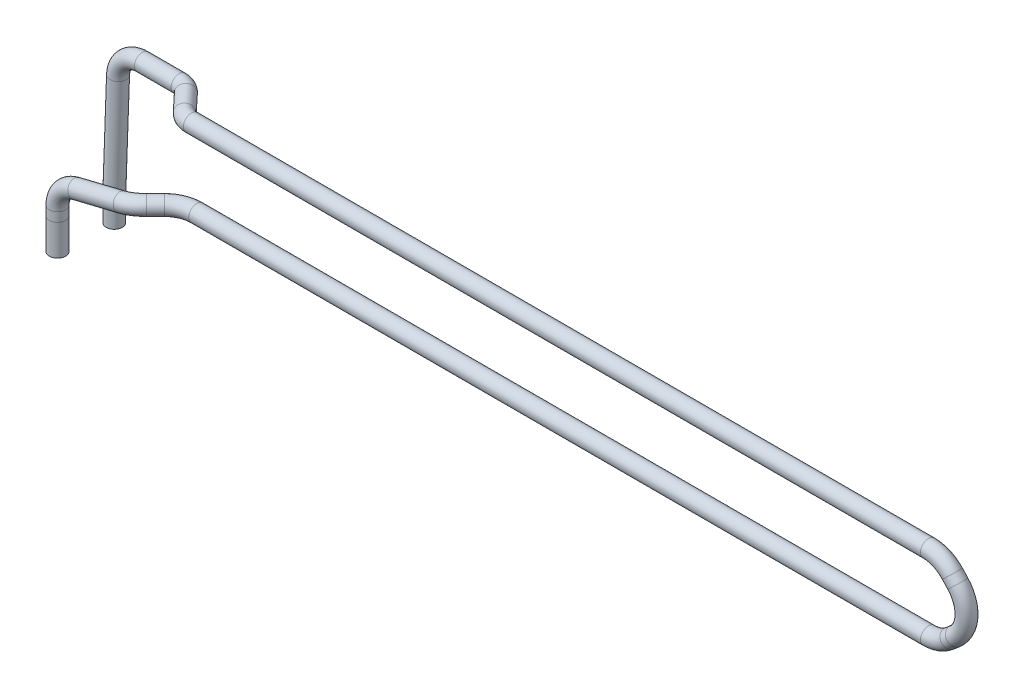
ISO-10303-21;
HEADER;
FILE_DESCRIPTION(('STEP AP214'),'2;1');
FILE_NAME('part.step','',(''),(''),'','','');
FILE_SCHEMA(('AUTOMOTIVE_DESIGN { 1 0 10303 214 1 1 1 1 }'));
ENDSEC;
DATA;
#1=APPLICATION_CONTEXT('core data for automotive mechanical design processes');
#2=APPLICATION_PROTOCOL_DEFINITION('international standard','automotive_design',2000,#1);
#3=PRODUCT_CONTEXT('',#1,'mechanical');
#4=PRODUCT('Part','Part','',(#3));
#5=PRODUCT_RELATED_PRODUCT_CATEGORY('part','',(#4));
#6=PRODUCT_DEFINITION_FORMATION('','',#4);
#7=PRODUCT_DEFINITION_CONTEXT('part definition',#1,'design');
#8=PRODUCT_DEFINITION('design','',#6,#7);
#9=PRODUCT_DEFINITION_SHAPE('','',#8);
#10=(LENGTH_UNIT() NAMED_UNIT(*) SI_UNIT(.MILLI.,.METRE.));
#11=(NAMED_UNIT(*) PLANE_ANGLE_UNIT() SI_UNIT($,.RADIAN.));
#12=(NAMED_UNIT(*) SI_UNIT($,.STERADIAN.) SOLID_ANGLE_UNIT());
#13=UNCERTAINTY_MEASURE_WITH_UNIT(LENGTH_MEASURE(1.E-05),#10,'distance_accuracy_value','');
#14=(GEOMETRIC_REPRESENTATION_CONTEXT(3) GLOBAL_UNCERTAINTY_ASSIGNED_CONTEXT((#13)) GLOBAL_UNIT_ASSIGNED_CONTEXT((#10,
#11,#12)) REPRESENTATION_CONTEXT('',''));
#15=CARTESIAN_POINT('',(0.,0.,0.));
#16=DIRECTION('',(0.,0.,1.));
#17=DIRECTION('',(1.,0.,0.));
#18=AXIS2_PLACEMENT_3D('',#15,#16,#17);
#19=CARTESIAN_POINT('',(-61.7173783748606,-14.4495134647805,-3.16147066816916));
#20=DIRECTION('',(0.,1.,0.));
#21=DIRECTION('',(0.,0.,1.));
#22=AXIS2_PLACEMENT_3D('',#19,#20,#21);
#23=PLANE('',#22);
#24=CARTESIAN_POINT('',(-61.7173783748606,-14.4495134647805,-3.16147066816916));
#25=DIRECTION('',(0.,1.,0.));
#26=DIRECTION('',(0.,0.,1.));
#27=AXIS2_PLACEMENT_3D('',#24,#25,#26);
#28=CIRCLE('',#27,1.);
#29=CARTESIAN_POINT('',(-61.7173783748606,-14.4495134647805,-2.16147066816916));
#30=VERTEX_POINT('',#29);
#31=EDGE_CURVE('E52',#30,#30,#28,.T.);
#32=ORIENTED_EDGE('',*,*,#31,.F.);
#33=EDGE_LOOP('',(#32));
#34=FACE_BOUND('',#33,.T.);
#35=ADVANCED_FACE('F49',(#34),#23,.F.);
#36=CARTESIAN_POINT('',(-62.0906123648648,-14.4017319108807,3.44671250446357));
#37=DIRECTION('',(0.,-1.,0.));
#38=DIRECTION('',(0.0991975804914856,0.,0.995067756499343));
#39=AXIS2_PLACEMENT_3D('',#36,#37,#38);
#40=PLANE('',#39);
#41=CARTESIAN_POINT('',(-62.0906123648648,-14.4017319108807,3.44671250446357));
#42=DIRECTION('',(0.,-1.,0.));
#43=DIRECTION('',(0.0991975804914856,0.,0.995067756499343));
#44=AXIS2_PLACEMENT_3D('',#41,#42,#43);
#45=CIRCLE('',#44,1.);
#46=CARTESIAN_POINT('',(-61.9914147843733,-14.4017319108807,4.44178026096291));
#47=VERTEX_POINT('',#46);
#48=EDGE_CURVE('E11',#47,#47,#45,.T.);
#49=ORIENTED_EDGE('',*,*,#48,.T.);
#50=EDGE_LOOP('',(#49));
#51=FACE_BOUND('',#50,.T.);
#52=ADVANCED_FACE('F78',(#51),#40,.T.);
#53=CARTESIAN_POINT('',(-61.7173783748606,-11.3645869698673,-3.16147066816916));
#54=DIRECTION('',(0.,-1.,0.));
#55=DIRECTION('',(0.,0.,-1.));
#56=AXIS2_PLACEMENT_3D('',#53,#54,#55);
#57=CYLINDRICAL_SURFACE('',#56,1.);
#58=CARTESIAN_POINT('',(-61.7173783748606,-11.5645869698673,-3.16147066816916));
#59=DIRECTION('',(-0.0178043012079039,-0.999841490866677,0.));
#60=DIRECTION('',(-0.999841490866677,0.0178043012079039,0.));
#61=AXIS2_PLACEMENT_3D('',#58,#59,#60);
#62=ELLIPSE('',#61,1.00015853426245,1.);
#63=CARTESIAN_POINT('',(-62.7173783748606,-11.5467798460676,-3.16147066816916));
#64=VERTEX_POINT('',#63);
#65=EDGE_CURVE('E64',#64,#64,#62,.T.);
#66=ORIENTED_EDGE('',*,*,#65,.T.);
#67=EDGE_LOOP('',(#66));
#68=FACE_BOUND('',#67,.T.);
#69=ORIENTED_EDGE('',*,*,#31,.T.);
#70=EDGE_LOOP('',(#69));
#71=FACE_BOUND('',#70,.T.);
#72=ADVANCED_FACE('F75',(#68,#71),#57,.T.);
#73=CARTESIAN_POINT('',(-62.0906123648648,-14.4017319108807,3.44671250446357));
#74=DIRECTION('',(0.,1.,0.));
#75=DIRECTION('',(0.,0.,1.));
#76=AXIS2_PLACEMENT_3D('',#73,#74,#75);
#77=CYLINDRICAL_SURFACE('',#76,1.);
#78=CARTESIAN_POINT('',(-62.0906123648648,-10.5909190140778,3.44671250446357));
#79=DIRECTION('',(0.,-1.,0.));
#80=DIRECTION('',(0.0991975804914856,0.,0.995067756499343));
#81=AXIS2_PLACEMENT_3D('',#78,#79,#80);
#82=CIRCLE('',#81,1.);
#83=CARTESIAN_POINT('',(-61.9914147843733,-10.5909190140778,4.44178026096291));
#84=VERTEX_POINT('',#83);
#85=EDGE_CURVE('E56',#84,#84,#82,.T.);
#86=ORIENTED_EDGE('',*,*,#85,.T.);
#87=EDGE_LOOP('',(#86));
#88=FACE_BOUND('',#87,.T.);
#89=ORIENTED_EDGE('',*,*,#48,.F.);
#90=EDGE_LOOP('',(#89));
#91=FACE_BOUND('',#90,.T.);
#92=ADVANCED_FACE('F97',(#88,#91),#77,.T.);
#93=CARTESIAN_POINT('',(-62.0906123648648,-10.5909190140778,3.44671250446357));
#94=DIRECTION('',(0.,1.,0.));
#95=DIRECTION('',(0.,0.,1.));
#96=AXIS2_PLACEMENT_3D('',#93,#94,#95);
#97=CYLINDRICAL_SURFACE('',#96,1.);
#98=CARTESIAN_POINT('',(-62.0906123648648,-9.45535480034576,3.44671250446357));
#99=DIRECTION('',(0.,-1.,0.));
#100=DIRECTION('',(0.0991975804914856,0.,0.995067756499343));
#101=AXIS2_PLACEMENT_3D('',#98,#99,#100);
#102=CIRCLE('',#101,1.);
#103=CARTESIAN_POINT('',(-63.0906123648648,-9.45535480034576,3.44671250446357));
#104=VERTEX_POINT('',#103);
#105=EDGE_CURVE('E61',#104,#104,#102,.T.);
#106=ORIENTED_EDGE('',*,*,#105,.T.);
#107=EDGE_LOOP('',(#106));
#108=FACE_BOUND('',#107,.T.);
#109=ORIENTED_EDGE('',*,*,#85,.F.);
#110=EDGE_LOOP('',(#109));
#111=FACE_BOUND('',#110,.T.);
#112=ADVANCED_FACE('F103',(#108,#111),#97,.T.);
#113=CARTESIAN_POINT('',(-59.0906123648648,-9.45535480034575,3.44671250446357));
#114=DIRECTION('',(0.,0.,-1.));
#115=DIRECTION('',(-1.,0.,0.));
#116=AXIS2_PLACEMENT_3D('',#113,#114,#115);
#117=TOROIDAL_SURFACE('',#116,2.99999999999999,1.);
#118=CARTESIAN_POINT('',(-59.8006105022769,-6.54058162823248,3.44671250446357));
#119=DIRECTION('',(-0.971591057371097,-0.236666045804028,0.));
#120=DIRECTION('',(0.0234766991282467,-0.0963794821183769,0.995067756499343));
#121=AXIS2_PLACEMENT_3D('',#118,#119,#120);
#122=CIRCLE('',#121,1.);
#123=CARTESIAN_POINT('',(-60.037276548081,-5.56899057086138,3.44671250446357));
#124=VERTEX_POINT('',#123);
#125=EDGE_CURVE('E228',#124,#124,#122,.T.);
#126=CARTESIAN_POINT('',(-59.0906123648648,-9.45535480034575,3.44671250446357));
#127=DIRECTION('',(0.,0.,-1.));
#128=DIRECTION('',(-1.,0.,0.));
#129=AXIS2_PLACEMENT_3D('',#126,#127,#128);
#130=CIRCLE('',#129,3.99999999999999);
#131=EDGE_CURVE('',#104,#124,#130,.T.);
#132=ORIENTED_EDGE('',*,*,#105,.F.);
#133=ORIENTED_EDGE('',*,*,#125,.T.);
#134=ORIENTED_EDGE('',*,*,#131,.T.);
#135=ORIENTED_EDGE('',*,*,#131,.F.);
#136=EDGE_LOOP('',(#132,#134,#133,#135));
#137=FACE_BOUND('',#136,.T.);
#138=ADVANCED_FACE('F108',(#137),#117,.T.);
#139=CARTESIAN_POINT('',(-59.8006105022769,-6.54058162823247,3.44671250446357));
#140=DIRECTION('',(0.971591057371097,0.236666045804028,0.));
#141=DIRECTION('',(-0.236666045804028,0.971591057371097,0.));
#142=AXIS2_PLACEMENT_3D('',#139,#140,#141);
#143=CYLINDRICAL_SURFACE('',#142,1.);
#144=CARTESIAN_POINT('',(-54.1950747975073,-5.17515122436408,3.44671250446357));
#145=DIRECTION('',(-0.971591057371097,-0.236666045804028,0.));
#146=DIRECTION('',(0.0234766991282467,-0.0963794821183769,0.995067756499343));
#147=AXIS2_PLACEMENT_3D('',#144,#145,#146);
#148=CIRCLE('',#147,1.);
#149=CARTESIAN_POINT('',(-54.2495799709438,-4.95138976795611,4.41983120056124));
#150=VERTEX_POINT('',#149);
#151=EDGE_CURVE('E225',#150,#150,#148,.T.);
#152=ORIENTED_EDGE('',*,*,#151,.T.);
#153=EDGE_LOOP('',(#152));
#154=FACE_BOUND('',#153,.T.);
#155=ORIENTED_EDGE('',*,*,#125,.F.);
#156=EDGE_LOOP('',(#155));
#157=FACE_BOUND('',#156,.T.);
#158=ADVANCED_FACE('F116',(#154,#157),#143,.T.);
#159=CARTESIAN_POINT('',(-54.0315592771976,-5.84643559358798,0.527356416170552));
#160=DIRECTION('',(-0.230304153903409,0.945473422889122,-0.230304153903404));
#161=DIRECTION('',(-0.971591057371097,-0.236666045804029,0.));
#162=AXIS2_PLACEMENT_3D('',#159,#160,#161);
#163=TOROIDAL_SURFACE('',#162,3.,1.);
#164=CARTESIAN_POINT('',(-52.0259072709279,-4.8693378198248,2.5330084224402));
#165=DIRECTION('',(-0.70710678118654,0.,0.707106781186555));
#166=DIRECTION('',(0.707106781186555,0.,0.70710678118654));
#167=AXIS2_PLACEMENT_3D('',#164,#165,#166);
#168=CIRCLE('',#167,1.);
#169=CARTESIAN_POINT('',(-51.3573566021713,-4.54363856190374,3.20155909119674));
#170=VERTEX_POINT('',#169);
#171=EDGE_CURVE('E222',#170,#170,#168,.T.);
#172=CARTESIAN_POINT('',(-54.0315592771976,-5.84643559358798,0.527356416170552));
#173=DIRECTION('',(-0.230304153903409,0.945473422889122,-0.230304153903404));
#174=DIRECTION('',(-0.971591057371097,-0.236666045804029,0.));
#175=AXIS2_PLACEMENT_3D('',#172,#173,#174);
#176=CIRCLE('',#175,4.);
#177=EDGE_CURVE('',#150,#170,#176,.T.);
#178=ORIENTED_EDGE('',*,*,#151,.F.);
#179=ORIENTED_EDGE('',*,*,#171,.T.);
#180=ORIENTED_EDGE('',*,*,#177,.T.);
#181=ORIENTED_EDGE('',*,*,#177,.F.);
#182=EDGE_LOOP('',(#178,#180,#179,#181));
#183=FACE_BOUND('',#182,.T.);
#184=ADVANCED_FACE('F123',(#183),#163,.T.);
#185=CARTESIAN_POINT('',(-52.0259072709279,-4.86933781982479,2.5330084224402));
#186=DIRECTION('',(0.707106781186541,0.,-0.707106781186554));
#187=DIRECTION('',(-0.707106781186554,0.,-0.707106781186541));
#188=AXIS2_PLACEMENT_3D('',#185,#186,#187);
#189=CYLINDRICAL_SURFACE('',#188,1.);
#190=CARTESIAN_POINT('',(-50.94404150072,-4.86933781982479,1.45114265223226));
#191=DIRECTION('',(-0.707106781186541,0.,0.707106781186555));
#192=DIRECTION('',(0.707106781186555,0.,0.707106781186541));
#193=AXIS2_PLACEMENT_3D('',#190,#191,#192);
#194=CIRCLE('',#193,1.);
#195=CARTESIAN_POINT('',(-51.6511482819065,-4.86933781982479,0.744035871045714));
#196=VERTEX_POINT('',#195);
#197=EDGE_CURVE('E219',#196,#196,#194,.T.);
#198=ORIENTED_EDGE('',*,*,#197,.T.);
#199=EDGE_LOOP('',(#198));
#200=FACE_BOUND('',#199,.T.);
#201=ORIENTED_EDGE('',*,*,#171,.F.);
#202=EDGE_LOOP('',(#201));
#203=FACE_BOUND('',#202,.T.);
#204=ADVANCED_FACE('F127',(#200,#203),#189,.T.);
#205=CARTESIAN_POINT('',(-48.1156143759737,-4.86933781982479,4.27956977697841));
#206=DIRECTION('',(0.,-1.,0.));
#207=DIRECTION('',(0.,0.,-1.));
#208=AXIS2_PLACEMENT_3D('',#205,#206,#207);
#209=TOROIDAL_SURFACE('',#208,4.,1.);
#210=CARTESIAN_POINT('',(-48.1156143759738,-4.86933781982479,0.279569776978417));
#211=DIRECTION('',(-1.,0.,0.));
#212=DIRECTION('',(0.,0.,1.));
#213=AXIS2_PLACEMENT_3D('',#210,#211,#212);
#214=CIRCLE('',#213,1.);
#215=CARTESIAN_POINT('',(-48.1156143759738,-4.86933781982479,-0.720430223021583));
#216=VERTEX_POINT('',#215);
#217=EDGE_CURVE('E216',#216,#216,#214,.T.);
#218=CARTESIAN_POINT('',(-48.1156143759737,-4.86933781982479,4.27956977697841));
#219=DIRECTION('',(0.,-1.,0.));
#220=DIRECTION('',(0.,0.,-1.));
#221=AXIS2_PLACEMENT_3D('',#218,#219,#220);
#222=CIRCLE('',#221,5.);
#223=EDGE_CURVE('',#196,#216,#222,.T.);
#224=ORIENTED_EDGE('',*,*,#197,.F.);
#225=ORIENTED_EDGE('',*,*,#217,.T.);
#226=ORIENTED_EDGE('',*,*,#223,.T.);
#227=ORIENTED_EDGE('',*,*,#223,.F.);
#228=EDGE_LOOP('',(#224,#226,#225,#227));
#229=FACE_BOUND('',#228,.T.);
#230=ADVANCED_FACE('F131',(#229),#209,.T.);
#231=CARTESIAN_POINT('',(-48.1156143759738,-4.86933781982479,0.279569776978416));
#232=DIRECTION('',(1.,0.,0.));
#233=DIRECTION('',(0.,0.,-1.));
#234=AXIS2_PLACEMENT_3D('',#231,#232,#233);
#235=CYLINDRICAL_SURFACE('',#234,1.);
#236=CARTESIAN_POINT('',(41.8919105632454,-4.86933781982479,0.279569776978416));
#237=DIRECTION('',(-1.,0.,0.));
#238=DIRECTION('',(0.,0.,1.));
#239=AXIS2_PLACEMENT_3D('',#236,#237,#238);
#240=CIRCLE('',#239,1.);
#241=CARTESIAN_POINT('',(41.8919105632454,-5.8693378198248,0.279569776978416));
#242=VERTEX_POINT('',#241);
#243=EDGE_CURVE('E213',#242,#242,#240,.T.);
#244=ORIENTED_EDGE('',*,*,#243,.T.);
#245=EDGE_LOOP('',(#244));
#246=FACE_BOUND('',#245,.T.);
#247=ORIENTED_EDGE('',*,*,#217,.F.);
#248=EDGE_LOOP('',(#247));
#249=FACE_BOUND('',#248,.T.);
#250=ADVANCED_FACE('F135',(#246,#249),#235,.T.);
#251=CARTESIAN_POINT('',(41.8919105632455,-0.869337819824794,0.279569776978414));
#252=DIRECTION('',(0.,0.,1.));
#253=DIRECTION('',(0.,-1.,0.));
#254=AXIS2_PLACEMENT_3D('',#251,#252,#253);
#255=TOROIDAL_SURFACE('',#254,4.00000000000001,1.);
#256=CARTESIAN_POINT('',(44.4939840949807,-3.90729985636227,0.279569776978416));
#257=DIRECTION('',(-0.759490509134364,-0.650518382933815,0.));
#258=DIRECTION('',(0.,0.,1.));
#259=AXIS2_PLACEMENT_3D('',#256,#257,#258);
#260=CIRCLE('',#259,1.);
#261=CARTESIAN_POINT('',(45.1445024779145,-4.66679036549662,0.279569776978416));
#262=VERTEX_POINT('',#261);
#263=EDGE_CURVE('E210',#262,#262,#260,.T.);
#264=CARTESIAN_POINT('',(41.8919105632455,-0.869337819824794,0.279569776978414));
#265=DIRECTION('',(0.,0.,1.));
#266=DIRECTION('',(0.,-1.,0.));
#267=AXIS2_PLACEMENT_3D('',#264,#265,#266);
#268=CIRCLE('',#267,5.00000000000001);
#269=EDGE_CURVE('',#242,#262,#268,.T.);
#270=ORIENTED_EDGE('',*,*,#243,.F.);
#271=ORIENTED_EDGE('',*,*,#263,.T.);
#272=ORIENTED_EDGE('',*,*,#269,.T.);
#273=ORIENTED_EDGE('',*,*,#269,.F.);
#274=EDGE_LOOP('',(#270,#272,#271,#273));
#275=FACE_BOUND('',#274,.T.);
#276=ADVANCED_FACE('F139',(#275),#255,.T.);
#277=CARTESIAN_POINT('',(44.4939840949807,-3.90729985636227,0.27956977697841));
#278=DIRECTION('',(0.759490509134364,0.650518382933814,0.));
#279=DIRECTION('',(-0.650518382933814,0.759490509134364,0.));
#280=AXIS2_PLACEMENT_3D('',#277,#278,#279);
#281=CYLINDRICAL_SURFACE('',#280,1.);
#282=CARTESIAN_POINT('',(45.1702905776292,-3.32803020892242,0.27956977697841));
#283=DIRECTION('',(-0.759490509134365,-0.650518382933814,0.));
#284=DIRECTION('',(0.,0.,1.));
#285=AXIS2_PLACEMENT_3D('',#282,#283,#284);
#286=CIRCLE('',#285,1.);
#287=CARTESIAN_POINT('',(45.820808960563,-4.08752071805678,0.279569776978408));
#288=VERTEX_POINT('',#287);
#289=EDGE_CURVE('E207',#288,#288,#286,.T.);
#290=ORIENTED_EDGE('',*,*,#289,.T.);
#291=EDGE_LOOP('',(#290));
#292=FACE_BOUND('',#291,.T.);
#293=ORIENTED_EDGE('',*,*,#263,.F.);
#294=EDGE_LOOP('',(#293));
#295=FACE_BOUND('',#294,.T.);
#296=ADVANCED_FACE('F143',(#292,#295),#281,.T.);
#297=CARTESIAN_POINT('',(42.568217045894,-0.290068172384948,0.279569776978416));
#298=DIRECTION('',(0.,0.,1.));
#299=DIRECTION('',(0.,-1.,0.));
#300=AXIS2_PLACEMENT_3D('',#297,#298,#299);
#301=TOROIDAL_SURFACE('',#300,4.00000000000001,1.);
#302=CARTESIAN_POINT('',(45.4991488600215,2.43199698130536,0.279569776978415));
#303=DIRECTION('',(0.680516288422576,-0.732732953531886,0.));
#304=DIRECTION('',(0.,0.,1.));
#305=AXIS2_PLACEMENT_3D('',#302,#303,#304);
#306=CIRCLE('',#305,1.);
#307=CARTESIAN_POINT('',(46.2318818135534,3.11251326972794,0.279569776978415));
#308=VERTEX_POINT('',#307);
#309=EDGE_CURVE('E204',#308,#308,#306,.T.);
#310=CARTESIAN_POINT('',(42.568217045894,-0.290068172384948,0.279569776978416));
#311=DIRECTION('',(0.,0.,1.));
#312=DIRECTION('',(0.,-1.,0.));
#313=AXIS2_PLACEMENT_3D('',#310,#311,#312);
#314=CIRCLE('',#313,5.00000000000001);
#315=EDGE_CURVE('',#288,#308,#314,.T.);
#316=ORIENTED_EDGE('',*,*,#289,.F.);
#317=ORIENTED_EDGE('',*,*,#309,.T.);
#318=ORIENTED_EDGE('',*,*,#315,.T.);
#319=ORIENTED_EDGE('',*,*,#315,.F.);
#320=EDGE_LOOP('',(#316,#318,#317,#319));
#321=FACE_BOUND('',#320,.T.);
#322=ADVANCED_FACE('F147',(#321),#301,.T.);
#323=CARTESIAN_POINT('',(45.4991488600215,2.43199698130535,0.279569776978414));
#324=DIRECTION('',(-0.680516288422575,0.732732953531888,0.));
#325=DIRECTION('',(-0.732732953531888,-0.680516288422575,0.));
#326=AXIS2_PLACEMENT_3D('',#323,#324,#325);
#327=CYLINDRICAL_SURFACE('',#326,1.);
#328=CARTESIAN_POINT('',(44.822842377373,3.16019710664327,0.279569776978415));
#329=DIRECTION('',(0.680516288422575,-0.732732953531888,0.));
#330=DIRECTION('',(0.,0.,1.));
#331=AXIS2_PLACEMENT_3D('',#328,#329,#330);
#332=CIRCLE('',#331,1.);
#333=CARTESIAN_POINT('',(45.5555753309049,3.84071339506585,0.279569776978415));
#334=VERTEX_POINT('',#333);
#335=EDGE_CURVE('E201',#334,#334,#332,.T.);
#336=ORIENTED_EDGE('',*,*,#335,.T.);
#337=EDGE_LOOP('',(#336));
#338=FACE_BOUND('',#337,.T.);
#339=ORIENTED_EDGE('',*,*,#309,.F.);
#340=EDGE_LOOP('',(#339));
#341=FACE_BOUND('',#340,.T.);
#342=ADVANCED_FACE('F151',(#338,#341),#327,.T.);
#343=CARTESIAN_POINT('',(41.8919105632454,0.438131952952978,0.279569776978414));
#344=DIRECTION('',(0.,0.,1.));
#345=DIRECTION('',(1.,0.,0.));
#346=AXIS2_PLACEMENT_3D('',#343,#344,#345);
#347=TOROIDAL_SURFACE('',#346,4.,1.);
#348=CARTESIAN_POINT('',(41.8919105632455,4.43813195295298,0.279569776978414));
#349=DIRECTION('',(1.,0.,0.));
#350=DIRECTION('',(0.,0.,1.));
#351=AXIS2_PLACEMENT_3D('',#348,#349,#350);
#352=CIRCLE('',#351,1.);
#353=CARTESIAN_POINT('',(41.8919105632455,5.43813195295298,0.279569776978414));
#354=VERTEX_POINT('',#353);
#355=EDGE_CURVE('E198',#354,#354,#352,.T.);
#356=CARTESIAN_POINT('',(41.8919105632454,0.438131952952978,0.279569776978414));
#357=DIRECTION('',(0.,0.,1.));
#358=DIRECTION('',(1.,0.,0.));
#359=AXIS2_PLACEMENT_3D('',#356,#357,#358);
#360=CIRCLE('',#359,5.);
#361=EDGE_CURVE('',#334,#354,#360,.T.);
#362=ORIENTED_EDGE('',*,*,#335,.F.);
#363=ORIENTED_EDGE('',*,*,#355,.T.);
#364=ORIENTED_EDGE('',*,*,#361,.T.);
#365=ORIENTED_EDGE('',*,*,#361,.F.);
#366=EDGE_LOOP('',(#362,#364,#363,#365));
#367=FACE_BOUND('',#366,.T.);
#368=ADVANCED_FACE('F155',(#367),#347,.T.);
#369=CARTESIAN_POINT('',(41.8919105632455,4.43813195295298,0.279569776978415));
#370=DIRECTION('',(-1.,0.,0.));
#371=DIRECTION('',(0.,0.,1.));
#372=AXIS2_PLACEMENT_3D('',#369,#370,#371);
#373=CYLINDRICAL_SURFACE('',#372,1.);
#374=CARTESIAN_POINT('',(-48.7759479234822,4.43813195295298,0.279569776978415));
#375=DIRECTION('',(1.,0.,0.));
#376=DIRECTION('',(0.,0.,1.));
#377=AXIS2_PLACEMENT_3D('',#374,#375,#376);
#378=CIRCLE('',#377,1.);
#379=CARTESIAN_POINT('',(-48.7759479234822,4.43813195295297,1.27956977697842));
#380=VERTEX_POINT('',#379);
#381=EDGE_CURVE('E195',#380,#380,#378,.T.);
#382=ORIENTED_EDGE('',*,*,#381,.T.);
#383=EDGE_LOOP('',(#382));
#384=FACE_BOUND('',#383,.T.);
#385=ORIENTED_EDGE('',*,*,#355,.F.);
#386=EDGE_LOOP('',(#385));
#387=FACE_BOUND('',#386,.T.);
#388=ADVANCED_FACE('F159',(#384,#387),#373,.T.);
#389=CARTESIAN_POINT('',(-48.7759479234822,4.43813195295299,-1.72043022302159));
#390=DIRECTION('',(0.,-1.,0.));
#391=DIRECTION('',(0.,0.,-1.));
#392=AXIS2_PLACEMENT_3D('',#389,#390,#391);
#393=TOROIDAL_SURFACE('',#392,2.,1.);
#394=CARTESIAN_POINT('',(-50.2365736335016,4.43813195295299,-0.354204569906211));
#395=DIRECTION('',(0.683112826557684,0.,0.730312855009667));
#396=DIRECTION('',(-0.730312855009667,0.,0.683112826557684));
#397=AXIS2_PLACEMENT_3D('',#394,#395,#396);
#398=CIRCLE('',#397,1.);
#399=CARTESIAN_POINT('',(-50.9668864885112,4.438131952953,0.328908256651473));
#400=VERTEX_POINT('',#399);
#401=EDGE_CURVE('E189',#400,#400,#398,.T.);
#402=CARTESIAN_POINT('',(-48.7759479234822,4.43813195295299,-1.72043022302159));
#403=DIRECTION('',(0.,-1.,0.));
#404=DIRECTION('',(0.,0.,-1.));
#405=AXIS2_PLACEMENT_3D('',#402,#403,#404);
#406=CIRCLE('',#405,3.);
#407=EDGE_CURVE('',#380,#400,#406,.T.);
#408=ORIENTED_EDGE('',*,*,#381,.F.);
#409=ORIENTED_EDGE('',*,*,#401,.T.);
#410=ORIENTED_EDGE('',*,*,#407,.T.);
#411=ORIENTED_EDGE('',*,*,#407,.F.);
#412=EDGE_LOOP('',(#408,#410,#409,#411));
#413=FACE_BOUND('',#412,.T.);
#414=ADVANCED_FACE('F163',(#413),#393,.T.);
#415=CARTESIAN_POINT('',(-50.2365736335015,4.43813195295299,-0.354204569906211));
#416=DIRECTION('',(-0.683112826557684,0.,-0.730312855009667));
#417=DIRECTION('',(-0.730312855009667,0.,0.683112826557684));
#418=AXIS2_PLACEMENT_3D('',#415,#416,#417);
#419=CYLINDRICAL_SURFACE('',#418,1.);
#420=CARTESIAN_POINT('',(-52.2695928849074,4.43813195295299,-2.52769632128452));
#421=DIRECTION('',(0.683112826557684,0.,0.730312855009667));
#422=DIRECTION('',(-0.730312855009668,0.,0.683112826557684));
#423=AXIS2_PLACEMENT_3D('',#420,#421,#422);
#424=CIRCLE('',#423,1.);
#425=CARTESIAN_POINT('',(-51.5392800298978,4.43813195295298,-3.2108091478422));
#426=VERTEX_POINT('',#425);
#427=EDGE_CURVE('E186',#426,#426,#424,.T.);
#428=ORIENTED_EDGE('',*,*,#427,.T.);
#429=EDGE_LOOP('',(#428));
#430=FACE_BOUND('',#429,.T.);
#431=ORIENTED_EDGE('',*,*,#401,.F.);
#432=EDGE_LOOP('',(#431));
#433=FACE_BOUND('',#432,.T.);
#434=ADVANCED_FACE('F167',(#430,#433),#419,.T.);
#435=CARTESIAN_POINT('',(-53.7302185949268,4.43813195295299,-1.16147066816916));
#436=DIRECTION('',(0.,1.,0.));
#437=DIRECTION('',(0.,0.,1.));
#438=AXIS2_PLACEMENT_3D('',#435,#436,#437);
#439=TOROIDAL_SURFACE('',#438,2.,1.);
#440=CARTESIAN_POINT('',(-53.7302185949268,4.43813195295299,-3.16147066816916));
#441=DIRECTION('',(1.,0.,0.));
#442=DIRECTION('',(0.,0.,1.));
#443=AXIS2_PLACEMENT_3D('',#440,#441,#442);
#444=CIRCLE('',#443,1.);
#445=CARTESIAN_POINT('',(-53.7302185949268,4.43813195295298,-4.16147066816916));
#446=VERTEX_POINT('',#445);
#447=EDGE_CURVE('E185',#446,#446,#444,.T.);
#448=CARTESIAN_POINT('',(-53.7302185949268,4.43813195295299,-1.16147066816916));
#449=DIRECTION('',(0.,1.,0.));
#450=DIRECTION('',(0.,0.,1.));
#451=AXIS2_PLACEMENT_3D('',#448,#449,#450);
#452=CIRCLE('',#451,3.);
#453=EDGE_CURVE('',#426,#446,#452,.T.);
#454=ORIENTED_EDGE('',*,*,#427,.F.);
#455=ORIENTED_EDGE('',*,*,#447,.T.);
#456=ORIENTED_EDGE('',*,*,#453,.T.);
#457=ORIENTED_EDGE('',*,*,#453,.F.);
#458=EDGE_LOOP('',(#454,#456,#455,#457));
#459=FACE_BOUND('',#458,.T.);
#460=ADVANCED_FACE('F171',(#459),#439,.T.);
#461=CARTESIAN_POINT('',(-53.7302185949268,4.43813195295299,-3.16147066816916));
#462=DIRECTION('',(-1.,0.,0.));
#463=DIRECTION('',(0.,0.,1.));
#464=AXIS2_PLACEMENT_3D('',#461,#462,#463);
#465=CYLINDRICAL_SURFACE('',#464,1.);
#466=CARTESIAN_POINT('',(-58.2522462712905,4.43813195295299,-3.16147066816916));
#467=DIRECTION('',(1.,0.,0.));
#468=DIRECTION('',(0.,0.,1.));
#469=AXIS2_PLACEMENT_3D('',#466,#467,#468);
#470=CIRCLE('',#469,1.);
#471=CARTESIAN_POINT('',(-58.2522462712905,5.43813195295299,-3.16147066816916));
#472=VERTEX_POINT('',#471);
#473=EDGE_CURVE('E70',#472,#472,#470,.T.);
#474=ORIENTED_EDGE('',*,*,#473,.T.);
#475=EDGE_LOOP('',(#474));
#476=FACE_BOUND('',#475,.T.);
#477=ORIENTED_EDGE('',*,*,#447,.F.);
#478=EDGE_LOOP('',(#477));
#479=FACE_BOUND('',#478,.T.);
#480=ADVANCED_FACE('F90',(#476,#479),#465,.T.);
#481=CARTESIAN_POINT('',(-58.2522462712905,1.43813195295298,-3.16147066816916));
#482=DIRECTION('',(0.,0.,1.));
#483=DIRECTION('',(0.,-1.,0.));
#484=AXIS2_PLACEMENT_3D('',#481,#482,#483);
#485=TOROIDAL_SURFACE('',#484,3.,1.);
#486=CARTESIAN_POINT('',(-61.2503443124415,1.54494082733429,-3.16147066816916));
#487=DIRECTION('',(0.0356029581270999,0.999366013716997,0.));
#488=DIRECTION('',(0.,0.,1.));
#489=AXIS2_PLACEMENT_3D('',#486,#487,#488);
#490=CIRCLE('',#489,1.);
#491=CARTESIAN_POINT('',(-62.2497103261585,1.58054378546139,-3.16147066816916));
#492=VERTEX_POINT('',#491);
#493=EDGE_CURVE('E66',#492,#492,#490,.T.);
#494=CARTESIAN_POINT('',(-58.2522462712905,1.43813195295298,-3.16147066816916));
#495=DIRECTION('',(0.,0.,1.));
#496=DIRECTION('',(0.,-1.,0.));
#497=AXIS2_PLACEMENT_3D('',#494,#495,#496);
#498=CIRCLE('',#497,4.);
#499=EDGE_CURVE('',#472,#492,#498,.T.);
#500=ORIENTED_EDGE('',*,*,#473,.F.);
#501=ORIENTED_EDGE('',*,*,#493,.T.);
#502=ORIENTED_EDGE('',*,*,#499,.T.);
#503=ORIENTED_EDGE('',*,*,#499,.F.);
#504=EDGE_LOOP('',(#500,#502,#501,#503));
#505=FACE_BOUND('',#504,.T.);
#506=ADVANCED_FACE('F84',(#505),#485,.T.);
#507=CARTESIAN_POINT('',(-61.2503443124415,1.54494082733429,-3.16147066816916));
#508=DIRECTION('',(-0.0356029581271,-0.999366013716997,0.));
#509=DIRECTION('',(0.999366013716996,-0.0356029581271,0.));
#510=AXIS2_PLACEMENT_3D('',#507,#508,#509);
#511=CYLINDRICAL_SURFACE('',#510,1.);
#512=ORIENTED_EDGE('',*,*,#493,.F.);
#513=EDGE_LOOP('',(#512));
#514=FACE_BOUND('',#513,.T.);
#515=ORIENTED_EDGE('',*,*,#65,.F.);
#516=EDGE_LOOP('',(#515));
#517=FACE_BOUND('',#516,.T.);
#518=ADVANCED_FACE('F82',(#514,#517),#511,.T.);
#519=CLOSED_SHELL('',(#35,#52,#72,#92,#112,#138,#158,#184,#204,#230,#250,#276,#296,#322,#342,
#368,#388,#414,#434,#460,#480,#506,#518));
#520=MANIFOLD_SOLID_BREP('B2',#519);
#521=ADVANCED_BREP_SHAPE_REPRESENTATION('',(#18,#520),#14);
#522=SHAPE_DEFINITION_REPRESENTATION(#9,#521);
ENDSEC;
END-ISO-10303-21;
